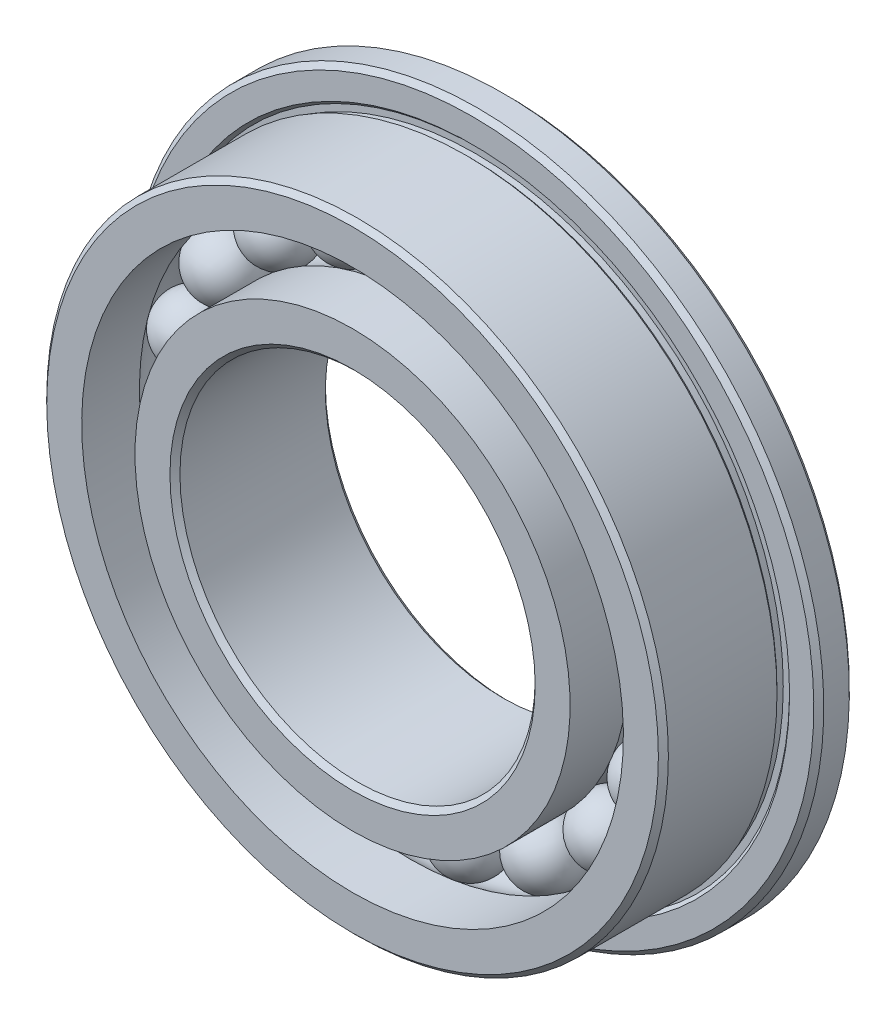
ISO-10303-21;
HEADER;
FILE_DESCRIPTION(('STEP AP214'),'2;1');
FILE_NAME('part.step','',(''),(''),'','','');
FILE_SCHEMA(('AUTOMOTIVE_DESIGN { 1 0 10303 214 1 1 1 1 }'));
ENDSEC;
DATA;
#1=APPLICATION_CONTEXT('core data for automotive mechanical design processes');
#2=APPLICATION_PROTOCOL_DEFINITION('international standard','automotive_design',2000,#1);
#3=PRODUCT_CONTEXT('',#1,'mechanical');
#4=PRODUCT('Part','Part','',(#3));
#5=PRODUCT_RELATED_PRODUCT_CATEGORY('part','',(#4));
#6=PRODUCT_DEFINITION_FORMATION('','',#4);
#7=PRODUCT_DEFINITION_CONTEXT('part definition',#1,'design');
#8=PRODUCT_DEFINITION('design','',#6,#7);
#9=PRODUCT_DEFINITION_SHAPE('','',#8);
#10=(LENGTH_UNIT() NAMED_UNIT(*) SI_UNIT(.MILLI.,.METRE.));
#11=(NAMED_UNIT(*) PLANE_ANGLE_UNIT() SI_UNIT($,.RADIAN.));
#12=(NAMED_UNIT(*) SI_UNIT($,.STERADIAN.) SOLID_ANGLE_UNIT());
#13=UNCERTAINTY_MEASURE_WITH_UNIT(LENGTH_MEASURE(1.E-05),#10,'distance_accuracy_value','');
#14=(GEOMETRIC_REPRESENTATION_CONTEXT(3) GLOBAL_UNCERTAINTY_ASSIGNED_CONTEXT((#13)) GLOBAL_UNIT_ASSIGNED_CONTEXT((#10,
#11,#12)) REPRESENTATION_CONTEXT('',''));
#15=CARTESIAN_POINT('',(0.,0.,0.));
#16=DIRECTION('',(0.,0.,1.));
#17=DIRECTION('',(1.,0.,0.));
#18=AXIS2_PLACEMENT_3D('',#15,#16,#17);
#19=CARTESIAN_POINT('',(-1.78584708062569,5.20199482935352,0.));
#20=DIRECTION('',(-0.324699469204671,0.945817241700639,0.));
#21=DIRECTION('',(0.945817241700639,0.324699469204671,0.));
#22=AXIS2_PLACEMENT_3D('',#19,#20,#21);
#23=SPHERICAL_SURFACE('',#22,0.75);
#24=CARTESIAN_POINT('',(-2.02937168252919,5.911357760629,0.));
#25=VERTEX_POINT('',#24);
#26=VERTEX_LOOP('',#25);
#27=FACE_BOUND('',#26,.T.);
#28=ADVANCED_FACE('F41',(#27),#23,.T.);
#29=CLOSED_SHELL('',(#28));
#30=MANIFOLD_SOLID_BREP('B2',#29);
#31=CARTESIAN_POINT('',(-3.37816991979312,4.34027280168021,0.));
#32=DIRECTION('',(-0.614212712689658,0.789140509396402,0.));
#33=DIRECTION('',(0.789140509396402,0.614212712689658,0.));
#34=AXIS2_PLACEMENT_3D('',#31,#32,#33);
#35=SPHERICAL_SURFACE('',#34,0.75);
#36=CARTESIAN_POINT('',(-3.83882945431036,4.93212818372751,0.));
#37=VERTEX_POINT('',#36);
#38=VERTEX_LOOP('',#37);
#39=FACE_BOUND('',#38,.T.);
#40=ADVANCED_FACE('F61',(#39),#35,.T.);
#41=CLOSED_SHELL('',(#40));
#42=MANIFOLD_SOLID_BREP('B7',#41);
#43=CARTESIAN_POINT('',(-4.60441563044387,3.0082148696734,0.));
#44=DIRECTION('',(-0.837166478262522,0.546948158122437,0.));
#45=DIRECTION('',(0.546948158122437,0.837166478262522,0.));
#46=AXIS2_PLACEMENT_3D('',#43,#44,#45);
#47=SPHERICAL_SURFACE('',#46,0.75);
#48=CARTESIAN_POINT('',(-5.23229048914076,3.41842598826523,0.));
#49=VERTEX_POINT('',#48);
#50=VERTEX_LOOP('',#49);
#51=FACE_BOUND('',#50,.T.);
#52=ADVANCED_FACE('F81',(#51),#47,.T.);
#53=CLOSED_SHELL('',(#52));
#54=MANIFOLD_SOLID_BREP('B37',#53);
#55=CARTESIAN_POINT('',(-5.3317014626663,1.35017017927445,0.));
#56=DIRECTION('',(-0.969400265939328,0.24548548714081,0.));
#57=DIRECTION('',(0.24548548714081,0.969400265939328,0.));
#58=AXIS2_PLACEMENT_3D('',#55,#56,#57);
#59=SPHERICAL_SURFACE('',#58,0.75);
#60=CARTESIAN_POINT('',(-6.0587516621208,1.53428429463006,0.));
#61=VERTEX_POINT('',#60);
#62=VERTEX_LOOP('',#61);
#63=FACE_BOUND('',#62,.T.);
#64=ADVANCED_FACE('F101',(#63),#59,.T.);
#65=CLOSED_SHELL('',(#64));
#66=MANIFOLD_SOLID_BREP('B57',#65);
#67=CARTESIAN_POINT('',(-5.48121471153669,-0.454186400097772,0.));
#68=DIRECTION('',(-0.996584493006671,-0.0825793454723223,0.));
#69=DIRECTION('',(-0.0825793454723223,0.996584493006671,0.));
#70=AXIS2_PLACEMENT_3D('',#67,#68,#69);
#71=SPHERICAL_SURFACE('',#70,0.75);
#72=CARTESIAN_POINT('',(-6.22865308129169,-0.516120909202013,0.));
#73=VERTEX_POINT('',#72);
#74=VERTEX_LOOP('',#73);
#75=FACE_BOUND('',#74,.T.);
#76=ADVANCED_FACE('F121',(#75),#71,.T.);
#77=CLOSED_SHELL('',(#76));
#78=MANIFOLD_SOLID_BREP('B77',#77);
#79=CARTESIAN_POINT('',(-5.03675329660284,-2.20932483559128,0.));
#80=DIRECTION('',(-0.915773326655062,-0.40169542465296,0.));
#81=DIRECTION('',(-0.40169542465296,0.915773326655062,0.));
#82=AXIS2_PLACEMENT_3D('',#79,#80,#81);
#83=SPHERICAL_SURFACE('',#82,0.75);
#84=CARTESIAN_POINT('',(-5.72358329159414,-2.510596404081,0.));
#85=VERTEX_POINT('',#84);
#86=VERTEX_LOOP('',#85);
#87=FACE_BOUND('',#86,.T.);
#88=ADVANCED_FACE('F141',(#87),#83,.T.);
#89=CLOSED_SHELL('',(#88));
#90=MANIFOLD_SOLID_BREP('B97',#89);
#91=CARTESIAN_POINT('',(-4.04648150870226,-3.72504864394154,0.));
#92=DIRECTION('',(-0.735723910673138,-0.677281571625734,0.));
#93=DIRECTION('',(-0.677281571625734,0.735723910673138,0.));
#94=AXIS2_PLACEMENT_3D('',#91,#92,#93);
#95=SPHERICAL_SURFACE('',#94,0.75);
#96=CARTESIAN_POINT('',(-4.59827444170711,-4.23300982266084,0.));
#97=VERTEX_POINT('',#96);
#98=VERTEX_LOOP('',#97);
#99=FACE_BOUND('',#98,.T.);
#100=ADVANCED_FACE('F161',(#99),#95,.T.);
#101=CLOSED_SHELL('',(#100));
#102=MANIFOLD_SOLID_BREP('B117',#101);
#103=CARTESIAN_POINT('',(-2.61771066170394,-4.83710563163567,0.));
#104=DIRECTION('',(-0.475947393037081,-0.879473751206485,0.));
#105=DIRECTION('',(-0.879473751206485,0.475947393037081,0.));
#106=AXIS2_PLACEMENT_3D('',#103,#104,#105);
#107=SPHERICAL_SURFACE('',#106,0.75);
#108=CARTESIAN_POINT('',(-2.97467120648176,-5.49671094504053,0.));
#109=VERTEX_POINT('',#108);
#110=VERTEX_LOOP('',#109);
#111=FACE_BOUND('',#110,.T.);
#112=ADVANCED_FACE('F181',(#111),#107,.T.);
#113=CLOSED_SHELL('',(#112));
#114=MANIFOLD_SOLID_BREP('B137',#113);
#115=CARTESIAN_POINT('',(-0.905270246544077,-5.42498716871497,0.));
#116=DIRECTION('',(-0.164594590280741,-0.986361303402721,0.));
#117=DIRECTION('',(-0.986361303402721,0.164594590280741,0.));
#118=AXIS2_PLACEMENT_3D('',#115,#116,#117);
#119=SPHERICAL_SURFACE('',#118,0.75);
#120=CARTESIAN_POINT('',(-1.02871618925463,-6.16475814626701,0.));
#121=VERTEX_POINT('',#120);
#122=VERTEX_LOOP('',#121);
#123=FACE_BOUND('',#122,.T.);
#124=ADVANCED_FACE('F201',(#123),#119,.T.);
#125=CLOSED_SHELL('',(#124));
#126=MANIFOLD_SOLID_BREP('B157',#125);
#127=CARTESIAN_POINT('',(0.905270246543999,-5.42498716871498,0.));
#128=DIRECTION('',(0.164594590280727,-0.986361303402724,0.));
#129=DIRECTION('',(-0.986361303402724,-0.164594590280727,0.));
#130=AXIS2_PLACEMENT_3D('',#127,#128,#129);
#131=SPHERICAL_SURFACE('',#130,0.75);
#132=CARTESIAN_POINT('',(1.02871618925454,-6.16475814626702,0.));
#133=VERTEX_POINT('',#132);
#134=VERTEX_LOOP('',#133);
#135=FACE_BOUND('',#134,.T.);
#136=ADVANCED_FACE('F221',(#135),#131,.T.);
#137=CLOSED_SHELL('',(#136));
#138=MANIFOLD_SOLID_BREP('B177',#137);
#139=CARTESIAN_POINT('',(2.61771066170388,-4.8371056316357,0.));
#140=DIRECTION('',(0.475947393037068,-0.879473751206492,0.));
#141=DIRECTION('',(-0.879473751206492,-0.475947393037068,0.));
#142=AXIS2_PLACEMENT_3D('',#139,#140,#141);
#143=SPHERICAL_SURFACE('',#142,0.75);
#144=CARTESIAN_POINT('',(2.97467120648168,-5.49671094504057,0.));
#145=VERTEX_POINT('',#144);
#146=VERTEX_LOOP('',#145);
#147=FACE_BOUND('',#146,.T.);
#148=ADVANCED_FACE('F241',(#147),#143,.T.);
#149=CLOSED_SHELL('',(#148));
#150=MANIFOLD_SOLID_BREP('B197',#149);
#151=CARTESIAN_POINT('',(4.0464815087022,-3.7250486439416,0.));
#152=DIRECTION('',(0.735723910673128,-0.677281571625745,0.));
#153=DIRECTION('',(-0.677281571625745,-0.735723910673128,0.));
#154=AXIS2_PLACEMENT_3D('',#151,#152,#153);
#155=SPHERICAL_SURFACE('',#154,0.75);
#156=CARTESIAN_POINT('',(4.59827444170705,-4.2330098226609,0.));
#157=VERTEX_POINT('',#156);
#158=VERTEX_LOOP('',#157);
#159=FACE_BOUND('',#158,.T.);
#160=ADVANCED_FACE('F261',(#159),#155,.T.);
#161=CLOSED_SHELL('',(#160));
#162=MANIFOLD_SOLID_BREP('B217',#161);
#163=CARTESIAN_POINT('',(5.03675329660281,-2.20932483559136,0.));
#164=DIRECTION('',(0.915773326655056,-0.401695424652974,0.));
#165=DIRECTION('',(-0.401695424652974,-0.915773326655056,0.));
#166=AXIS2_PLACEMENT_3D('',#163,#164,#165);
#167=SPHERICAL_SURFACE('',#166,0.75);
#168=CARTESIAN_POINT('',(5.7235832915941,-2.51059640408109,0.));
#169=VERTEX_POINT('',#168);
#170=VERTEX_LOOP('',#169);
#171=FACE_BOUND('',#170,.T.);
#172=ADVANCED_FACE('F281',(#171),#167,.T.);
#173=CLOSED_SHELL('',(#172));
#174=MANIFOLD_SOLID_BREP('B237',#173);
#175=CARTESIAN_POINT('',(5.48121471153668,-0.454186400097848,0.));
#176=DIRECTION('',(0.99658449300667,-0.0825793454723359,0.));
#177=DIRECTION('',(-0.0825793454723359,-0.99658449300667,0.));
#178=AXIS2_PLACEMENT_3D('',#175,#176,#177);
#179=SPHERICAL_SURFACE('',#178,0.75);
#180=CARTESIAN_POINT('',(6.22865308129169,-0.5161209092021,0.));
#181=VERTEX_POINT('',#180);
#182=VERTEX_LOOP('',#181);
#183=FACE_BOUND('',#182,.T.);
#184=ADVANCED_FACE('F301',(#183),#179,.T.);
#185=CLOSED_SHELL('',(#184));
#186=MANIFOLD_SOLID_BREP('B257',#185);
#187=CARTESIAN_POINT('',(5.33170146266632,1.35017017927438,0.));
#188=DIRECTION('',(0.969400265939331,0.245485487140796,0.));
#189=DIRECTION('',(0.245485487140796,-0.969400265939331,0.));
#190=AXIS2_PLACEMENT_3D('',#187,#188,#189);
#191=SPHERICAL_SURFACE('',#190,0.75);
#192=CARTESIAN_POINT('',(6.05875166212082,1.53428429462998,0.));
#193=VERTEX_POINT('',#192);
#194=VERTEX_LOOP('',#193);
#195=FACE_BOUND('',#194,.T.);
#196=ADVANCED_FACE('F321',(#195),#191,.T.);
#197=CLOSED_SHELL('',(#196));
#198=MANIFOLD_SOLID_BREP('B277',#197);
#199=CARTESIAN_POINT('',(4.60441563044391,3.00821486967334,0.));
#200=DIRECTION('',(0.83716647826253,0.546948158122425,0.));
#201=DIRECTION('',(0.546948158122425,-0.83716647826253,0.));
#202=AXIS2_PLACEMENT_3D('',#199,#200,#201);
#203=SPHERICAL_SURFACE('',#202,0.75);
#204=CARTESIAN_POINT('',(5.23229048914081,3.41842598826516,0.));
#205=VERTEX_POINT('',#204);
#206=VERTEX_LOOP('',#205);
#207=FACE_BOUND('',#206,.T.);
#208=ADVANCED_FACE('F341',(#207),#203,.T.);
#209=CLOSED_SHELL('',(#208));
#210=MANIFOLD_SOLID_BREP('B297',#209);
#211=CARTESIAN_POINT('',(3.37816991979318,4.34027280168016,0.));
#212=DIRECTION('',(0.614212712689669,0.789140509396393,0.));
#213=DIRECTION('',(0.789140509396393,-0.614212712689669,0.));
#214=AXIS2_PLACEMENT_3D('',#211,#212,#213);
#215=SPHERICAL_SURFACE('',#214,0.75);
#216=CARTESIAN_POINT('',(3.83882945431043,4.93212818372745,0.));
#217=VERTEX_POINT('',#216);
#218=VERTEX_LOOP('',#217);
#219=FACE_BOUND('',#218,.T.);
#220=ADVANCED_FACE('F361',(#219),#215,.T.);
#221=CLOSED_SHELL('',(#220));
#222=MANIFOLD_SOLID_BREP('B317',#221);
#223=CARTESIAN_POINT('',(1.78584708062576,5.20199482935349,0.));
#224=DIRECTION('',(0.324699469204684,0.945817241700635,0.));
#225=DIRECTION('',(0.945817241700635,-0.324699469204684,0.));
#226=AXIS2_PLACEMENT_3D('',#223,#224,#225);
#227=SPHERICAL_SURFACE('',#226,0.75);
#228=CARTESIAN_POINT('',(2.02937168252928,5.91135776062897,0.));
#229=VERTEX_POINT('',#228);
#230=VERTEX_LOOP('',#229);
#231=FACE_BOUND('',#230,.T.);
#232=ADVANCED_FACE('F381',(#231),#227,.T.);
#233=CLOSED_SHELL('',(#232));
#234=MANIFOLD_SOLID_BREP('B337',#233);
#235=CARTESIAN_POINT('',(0.,5.5,0.));
#236=DIRECTION('',(0.,1.,0.));
#237=DIRECTION('',(1.,0.,0.));
#238=AXIS2_PLACEMENT_3D('',#235,#236,#237);
#239=SPHERICAL_SURFACE('',#238,0.75);
#240=CARTESIAN_POINT('',(0.,6.25,0.));
#241=VERTEX_POINT('',#240);
#242=VERTEX_LOOP('',#241);
#243=FACE_BOUND('',#242,.T.);
#244=ADVANCED_FACE('F404',(#243),#239,.T.);
#245=CLOSED_SHELL('',(#244));
#246=MANIFOLD_SOLID_BREP('B357',#245);
#247=CARTESIAN_POINT('',(0.,0.,0.));
#248=DIRECTION('',(0.,0.,1.));
#249=DIRECTION('',(0.,-1.,0.));
#250=AXIS2_PLACEMENT_3D('',#247,#248,#249);
#251=CYLINDRICAL_SURFACE('',#250,4.9);
#252=CARTESIAN_POINT('',(0.,0.,-0.449999999999999));
#253=DIRECTION('',(0.,0.,1.));
#254=DIRECTION('',(0.,-1.,0.));
#255=AXIS2_PLACEMENT_3D('',#252,#253,#254);
#256=CIRCLE('',#255,4.9);
#257=CARTESIAN_POINT('',(0.,-4.9,-0.449999999999999));
#258=VERTEX_POINT('',#257);
#259=EDGE_CURVE('E445',#258,#258,#256,.T.);
#260=ORIENTED_EDGE('',*,*,#259,.F.);
#261=EDGE_LOOP('',(#260));
#262=FACE_BOUND('',#261,.T.);
#263=CARTESIAN_POINT('',(0.,0.,-1.75));
#264=DIRECTION('',(0.,0.,1.));
#265=DIRECTION('',(0.,-1.,0.));
#266=AXIS2_PLACEMENT_3D('',#263,#264,#265);
#267=CIRCLE('',#266,4.9);
#268=CARTESIAN_POINT('',(0.,-4.9,-1.75));
#269=VERTEX_POINT('',#268);
#270=EDGE_CURVE('E454',#269,#269,#267,.T.);
#271=ORIENTED_EDGE('',*,*,#270,.T.);
#272=EDGE_LOOP('',(#271));
#273=FACE_BOUND('',#272,.T.);
#274=ADVANCED_FACE('F425',(#262,#273),#251,.T.);
#275=CARTESIAN_POINT('',(0.,0.,0.));
#276=DIRECTION('',(0.,0.,1.));
#277=DIRECTION('',(0.,-1.,0.));
#278=AXIS2_PLACEMENT_3D('',#275,#276,#277);
#279=TOROIDAL_SURFACE('',#278,5.5,0.75);
#280=CARTESIAN_POINT('',(0.,0.,0.45));
#281=DIRECTION('',(0.,0.,1.));
#282=DIRECTION('',(0.,-1.,0.));
#283=AXIS2_PLACEMENT_3D('',#280,#281,#282);
#284=CIRCLE('',#283,4.9);
#285=CARTESIAN_POINT('',(0.,-4.9,0.45));
#286=VERTEX_POINT('',#285);
#287=EDGE_CURVE('E448',#286,#286,#284,.T.);
#288=ORIENTED_EDGE('',*,*,#287,.F.);
#289=EDGE_LOOP('',(#288));
#290=FACE_BOUND('',#289,.T.);
#291=ORIENTED_EDGE('',*,*,#259,.T.);
#292=EDGE_LOOP('',(#291));
#293=FACE_BOUND('',#292,.T.);
#294=ADVANCED_FACE('F473',(#290,#293),#279,.F.);
#295=CARTESIAN_POINT('',(0.,0.,0.));
#296=DIRECTION('',(0.,0.,1.));
#297=DIRECTION('',(0.,-1.,0.));
#298=AXIS2_PLACEMENT_3D('',#295,#296,#297);
#299=CYLINDRICAL_SURFACE('',#298,4.9);
#300=CARTESIAN_POINT('',(0.,0.,1.75));
#301=DIRECTION('',(0.,0.,1.));
#302=DIRECTION('',(0.,-1.,0.));
#303=AXIS2_PLACEMENT_3D('',#300,#301,#302);
#304=CIRCLE('',#303,4.9);
#305=CARTESIAN_POINT('',(0.,-4.9,1.75));
#306=VERTEX_POINT('',#305);
#307=EDGE_CURVE('E451',#306,#306,#304,.T.);
#308=ORIENTED_EDGE('',*,*,#307,.F.);
#309=EDGE_LOOP('',(#308));
#310=FACE_BOUND('',#309,.T.);
#311=ORIENTED_EDGE('',*,*,#287,.T.);
#312=EDGE_LOOP('',(#311));
#313=FACE_BOUND('',#312,.T.);
#314=ADVANCED_FACE('F479',(#310,#313),#299,.T.);
#315=CARTESIAN_POINT('',(0.,4.,1.75));
#316=DIRECTION('',(0.,0.,-1.));
#317=DIRECTION('',(0.,1.,0.));
#318=AXIS2_PLACEMENT_3D('',#315,#316,#317);
#319=PLANE('',#318);
#320=CARTESIAN_POINT('',(0.,0.,1.75));
#321=DIRECTION('',(0.,0.,-1.));
#322=DIRECTION('',(0.,1.,0.));
#323=AXIS2_PLACEMENT_3D('',#320,#321,#322);
#324=CIRCLE('',#323,4.1125);
#325=CARTESIAN_POINT('',(0.,4.1125,1.75));
#326=VERTEX_POINT('',#325);
#327=EDGE_CURVE('E403',#326,#326,#324,.T.);
#328=ORIENTED_EDGE('',*,*,#327,.T.);
#329=EDGE_LOOP('',(#328));
#330=FACE_BOUND('',#329,.T.);
#331=ORIENTED_EDGE('',*,*,#307,.T.);
#332=EDGE_LOOP('',(#331));
#333=FACE_BOUND('',#332,.T.);
#334=ADVANCED_FACE('F470',(#330,#333),#319,.F.);
#335=CARTESIAN_POINT('',(0.,0.,0.));
#336=DIRECTION('',(0.,0.,1.));
#337=DIRECTION('',(0.,-1.,0.));
#338=AXIS2_PLACEMENT_3D('',#335,#336,#337);
#339=CYLINDRICAL_SURFACE('',#338,4.);
#340=CARTESIAN_POINT('',(0.,0.,-1.6375));
#341=DIRECTION('',(0.,0.,1.));
#342=DIRECTION('',(0.,-1.,0.));
#343=AXIS2_PLACEMENT_3D('',#340,#341,#342);
#344=CIRCLE('',#343,4.);
#345=CARTESIAN_POINT('',(0.,-4.,-1.6375));
#346=VERTEX_POINT('',#345);
#347=EDGE_CURVE('E432',#346,#346,#344,.F.);
#348=ORIENTED_EDGE('',*,*,#347,.T.);
#349=EDGE_LOOP('',(#348));
#350=FACE_BOUND('',#349,.T.);
#351=CARTESIAN_POINT('',(0.,0.,1.6375));
#352=DIRECTION('',(0.,0.,-1.));
#353=DIRECTION('',(0.,1.,0.));
#354=AXIS2_PLACEMENT_3D('',#351,#352,#353);
#355=CIRCLE('',#354,4.);
#356=CARTESIAN_POINT('',(0.,4.,1.6375));
#357=VERTEX_POINT('',#356);
#358=EDGE_CURVE('E436',#357,#357,#355,.F.);
#359=ORIENTED_EDGE('',*,*,#358,.T.);
#360=EDGE_LOOP('',(#359));
#361=FACE_BOUND('',#360,.T.);
#362=ADVANCED_FACE('F462',(#350,#361),#339,.F.);
#363=CARTESIAN_POINT('',(0.,4.9,-1.75));
#364=DIRECTION('',(0.,0.,1.));
#365=DIRECTION('',(0.,-1.,0.));
#366=AXIS2_PLACEMENT_3D('',#363,#364,#365);
#367=PLANE('',#366);
#368=CARTESIAN_POINT('',(0.,0.,-1.75));
#369=DIRECTION('',(0.,0.,1.));
#370=DIRECTION('',(0.,-1.,0.));
#371=AXIS2_PLACEMENT_3D('',#368,#369,#370);
#372=CIRCLE('',#371,4.1125);
#373=CARTESIAN_POINT('',(0.,-4.1125,-1.75));
#374=VERTEX_POINT('',#373);
#375=EDGE_CURVE('E440',#374,#374,#372,.T.);
#376=ORIENTED_EDGE('',*,*,#375,.T.);
#377=EDGE_LOOP('',(#376));
#378=FACE_BOUND('',#377,.T.);
#379=ORIENTED_EDGE('',*,*,#270,.F.);
#380=EDGE_LOOP('',(#379));
#381=FACE_BOUND('',#380,.T.);
#382=ADVANCED_FACE('F459',(#378,#381),#367,.F.);
#383=CARTESIAN_POINT('',(0.,0.,-1.75));
#384=DIRECTION('',(0.,0.,-1.));
#385=DIRECTION('',(0.,1.,0.));
#386=AXIS2_PLACEMENT_3D('',#383,#384,#385);
#387=CONICAL_SURFACE('',#386,4.1125,0.785398163397446);
#388=ORIENTED_EDGE('',*,*,#347,.F.);
#389=EDGE_LOOP('',(#388));
#390=FACE_BOUND('',#389,.T.);
#391=ORIENTED_EDGE('',*,*,#375,.F.);
#392=EDGE_LOOP('',(#391));
#393=FACE_BOUND('',#392,.T.);
#394=ADVANCED_FACE('F461',(#390,#393),#387,.F.);
#395=CARTESIAN_POINT('',(0.,0.,1.6375));
#396=DIRECTION('',(0.,0.,1.));
#397=DIRECTION('',(0.,-1.,0.));
#398=AXIS2_PLACEMENT_3D('',#395,#396,#397);
#399=CONICAL_SURFACE('',#398,4.,0.785398163397446);
#400=ORIENTED_EDGE('',*,*,#327,.F.);
#401=EDGE_LOOP('',(#400));
#402=FACE_BOUND('',#401,.T.);
#403=ORIENTED_EDGE('',*,*,#358,.F.);
#404=EDGE_LOOP('',(#403));
#405=FACE_BOUND('',#404,.T.);
#406=ADVANCED_FACE('F427',(#402,#405),#399,.F.);
#407=CLOSED_SHELL('',(#274,#294,#314,#334,#362,#382,#394,#406));
#408=MANIFOLD_SOLID_BREP('B377',#407);
#409=CARTESIAN_POINT('',(0.,6.1,-1.75));
#410=DIRECTION('',(0.,0.,1.));
#411=DIRECTION('',(0.,-1.,0.));
#412=AXIS2_PLACEMENT_3D('',#409,#410,#411);
#413=PLANE('',#412);
#414=CARTESIAN_POINT('',(0.,0.,-1.75));
#415=DIRECTION('',(0.,0.,1.));
#416=DIRECTION('',(0.,-1.,0.));
#417=AXIS2_PLACEMENT_3D('',#414,#415,#416);
#418=CIRCLE('',#417,7.6875);
#419=CARTESIAN_POINT('',(0.,-7.6875,-1.75));
#420=VERTEX_POINT('',#419);
#421=EDGE_CURVE('E562',#420,#420,#418,.F.);
#422=ORIENTED_EDGE('',*,*,#421,.T.);
#423=EDGE_LOOP('',(#422));
#424=FACE_BOUND('',#423,.T.);
#425=CARTESIAN_POINT('',(0.,0.,-1.75));
#426=DIRECTION('',(0.,0.,1.));
#427=DIRECTION('',(0.,-1.,0.));
#428=AXIS2_PLACEMENT_3D('',#425,#426,#427);
#429=CIRCLE('',#428,6.1);
#430=CARTESIAN_POINT('',(0.,-6.1,-1.75));
#431=VERTEX_POINT('',#430);
#432=EDGE_CURVE('E573',#431,#431,#429,.T.);
#433=ORIENTED_EDGE('',*,*,#432,.T.);
#434=EDGE_LOOP('',(#433));
#435=FACE_BOUND('',#434,.T.);
#436=ADVANCED_FACE('F547',(#424,#435),#413,.F.);
#437=CARTESIAN_POINT('',(0.,0.,0.));
#438=DIRECTION('',(0.,0.,1.));
#439=DIRECTION('',(0.,-1.,0.));
#440=AXIS2_PLACEMENT_3D('',#437,#438,#439);
#441=CYLINDRICAL_SURFACE('',#440,6.1);
#442=ORIENTED_EDGE('',*,*,#432,.F.);
#443=EDGE_LOOP('',(#442));
#444=FACE_BOUND('',#443,.T.);
#445=CARTESIAN_POINT('',(0.,0.,-0.45));
#446=DIRECTION('',(0.,0.,1.));
#447=DIRECTION('',(0.,-1.,0.));
#448=AXIS2_PLACEMENT_3D('',#445,#446,#447);
#449=CIRCLE('',#448,6.1);
#450=CARTESIAN_POINT('',(0.,-6.1,-0.45));
#451=VERTEX_POINT('',#450);
#452=EDGE_CURVE('E576',#451,#451,#449,.T.);
#453=ORIENTED_EDGE('',*,*,#452,.T.);
#454=EDGE_LOOP('',(#453));
#455=FACE_BOUND('',#454,.T.);
#456=ADVANCED_FACE('F619',(#444,#455),#441,.F.);
#457=CARTESIAN_POINT('',(0.,0.,0.));
#458=DIRECTION('',(0.,0.,1.));
#459=DIRECTION('',(0.,-1.,0.));
#460=AXIS2_PLACEMENT_3D('',#457,#458,#459);
#461=TOROIDAL_SURFACE('',#460,5.5,0.75);
#462=ORIENTED_EDGE('',*,*,#452,.F.);
#463=EDGE_LOOP('',(#462));
#464=FACE_BOUND('',#463,.T.);
#465=CARTESIAN_POINT('',(0.,0.,0.45));
#466=DIRECTION('',(0.,0.,1.));
#467=DIRECTION('',(0.,-1.,0.));
#468=AXIS2_PLACEMENT_3D('',#465,#466,#467);
#469=CIRCLE('',#468,6.1);
#470=CARTESIAN_POINT('',(0.,-6.1,0.45));
#471=VERTEX_POINT('',#470);
#472=EDGE_CURVE('E579',#471,#471,#469,.T.);
#473=ORIENTED_EDGE('',*,*,#472,.T.);
#474=EDGE_LOOP('',(#473));
#475=FACE_BOUND('',#474,.T.);
#476=ADVANCED_FACE('F625',(#464,#475),#461,.F.);
#477=CARTESIAN_POINT('',(0.,0.,0.));
#478=DIRECTION('',(0.,0.,1.));
#479=DIRECTION('',(0.,-1.,0.));
#480=AXIS2_PLACEMENT_3D('',#477,#478,#479);
#481=CYLINDRICAL_SURFACE('',#480,6.1);
#482=ORIENTED_EDGE('',*,*,#472,.F.);
#483=EDGE_LOOP('',(#482));
#484=FACE_BOUND('',#483,.T.);
#485=CARTESIAN_POINT('',(0.,0.,1.75));
#486=DIRECTION('',(0.,0.,1.));
#487=DIRECTION('',(0.,-1.,0.));
#488=AXIS2_PLACEMENT_3D('',#485,#486,#487);
#489=CIRCLE('',#488,6.1);
#490=CARTESIAN_POINT('',(0.,-6.1,1.75));
#491=VERTEX_POINT('',#490);
#492=EDGE_CURVE('E582',#491,#491,#489,.T.);
#493=ORIENTED_EDGE('',*,*,#492,.T.);
#494=EDGE_LOOP('',(#493));
#495=FACE_BOUND('',#494,.T.);
#496=ADVANCED_FACE('F689',(#484,#495),#481,.F.);
#497=CARTESIAN_POINT('',(0.,7.,1.75));
#498=DIRECTION('',(0.,0.,-1.));
#499=DIRECTION('',(0.,1.,0.));
#500=AXIS2_PLACEMENT_3D('',#497,#498,#499);
#501=PLANE('',#500);
#502=CARTESIAN_POINT('',(0.,0.,1.75));
#503=DIRECTION('',(0.,0.,-1.));
#504=DIRECTION('',(0.,1.,0.));
#505=AXIS2_PLACEMENT_3D('',#502,#503,#504);
#506=CIRCLE('',#505,6.8875);
#507=CARTESIAN_POINT('',(0.,6.8875,1.75));
#508=VERTEX_POINT('',#507);
#509=EDGE_CURVE('E554',#508,#508,#506,.F.);
#510=ORIENTED_EDGE('',*,*,#509,.T.);
#511=EDGE_LOOP('',(#510));
#512=FACE_BOUND('',#511,.T.);
#513=ORIENTED_EDGE('',*,*,#492,.F.);
#514=EDGE_LOOP('',(#513));
#515=FACE_BOUND('',#514,.T.);
#516=ADVANCED_FACE('F679',(#512,#515),#501,.F.);
#517=CARTESIAN_POINT('',(0.,0.,0.));
#518=DIRECTION('',(0.,0.,1.));
#519=DIRECTION('',(0.,-1.,0.));
#520=AXIS2_PLACEMENT_3D('',#517,#518,#519);
#521=CYLINDRICAL_SURFACE('',#520,7.);
#522=CARTESIAN_POINT('',(0.,0.,1.6375));
#523=DIRECTION('',(0.,0.,-1.));
#524=DIRECTION('',(0.,1.,0.));
#525=AXIS2_PLACEMENT_3D('',#522,#523,#524);
#526=CIRCLE('',#525,7.);
#527=CARTESIAN_POINT('',(0.,7.,1.6375));
#528=VERTEX_POINT('',#527);
#529=EDGE_CURVE('E424',#528,#528,#526,.T.);
#530=ORIENTED_EDGE('',*,*,#529,.T.);
#531=EDGE_LOOP('',(#530));
#532=FACE_BOUND('',#531,.T.);
#533=CARTESIAN_POINT('',(0.,0.,-0.808578643762693));
#534=DIRECTION('',(0.,0.,1.));
#535=DIRECTION('',(0.,-1.,0.));
#536=AXIS2_PLACEMENT_3D('',#533,#534,#535);
#537=CIRCLE('',#536,7.);
#538=CARTESIAN_POINT('',(0.,-7.,-0.808578643762693));
#539=VERTEX_POINT('',#538);
#540=EDGE_CURVE('E585',#539,#539,#537,.T.);
#541=ORIENTED_EDGE('',*,*,#540,.T.);
#542=EDGE_LOOP('',(#541));
#543=FACE_BOUND('',#542,.T.);
#544=ADVANCED_FACE('F673',(#532,#543),#521,.T.);
#545=CARTESIAN_POINT('',(0.,0.,-0.879289321881346));
#546=DIRECTION('',(0.,0.,1.));
#547=DIRECTION('',(0.,-1.,0.));
#548=AXIS2_PLACEMENT_3D('',#545,#546,#547);
#549=CONICAL_SURFACE('',#548,6.92928932188135,0.78539816339745);
#550=ORIENTED_EDGE('',*,*,#540,.F.);
#551=EDGE_LOOP('',(#550));
#552=FACE_BOUND('',#551,.T.);
#553=CARTESIAN_POINT('',(0.,0.,-0.879289321881346));
#554=DIRECTION('',(0.,0.,1.));
#555=DIRECTION('',(0.,-1.,0.));
#556=AXIS2_PLACEMENT_3D('',#553,#554,#555);
#557=CIRCLE('',#556,6.92928932188135);
#558=CARTESIAN_POINT('',(0.,-6.92928932188135,-0.879289321881347));
#559=VERTEX_POINT('',#558);
#560=EDGE_CURVE('E588',#559,#559,#557,.T.);
#561=ORIENTED_EDGE('',*,*,#560,.T.);
#562=EDGE_LOOP('',(#561));
#563=FACE_BOUND('',#562,.T.);
#564=ADVANCED_FACE('F678',(#552,#563),#549,.T.);
#565=CARTESIAN_POINT('',(0.,0.,0.));
#566=DIRECTION('',(0.,0.,1.));
#567=DIRECTION('',(0.,-1.,0.));
#568=AXIS2_PLACEMENT_3D('',#565,#566,#567);
#569=CYLINDRICAL_SURFACE('',#568,6.92928932188135);
#570=ORIENTED_EDGE('',*,*,#560,.F.);
#571=EDGE_LOOP('',(#570));
#572=FACE_BOUND('',#571,.T.);
#573=CARTESIAN_POINT('',(0.,0.,-1.02071067811866));
#574=DIRECTION('',(0.,0.,1.));
#575=DIRECTION('',(0.,-1.,0.));
#576=AXIS2_PLACEMENT_3D('',#573,#574,#575);
#577=CIRCLE('',#576,6.92928932188135);
#578=CARTESIAN_POINT('',(0.,-6.92928932188135,-1.02071067811866));
#579=VERTEX_POINT('',#578);
#580=EDGE_CURVE('E591',#579,#579,#577,.T.);
#581=ORIENTED_EDGE('',*,*,#580,.T.);
#582=EDGE_LOOP('',(#581));
#583=FACE_BOUND('',#582,.T.);
#584=ADVANCED_FACE('F711',(#572,#583),#569,.T.);
#585=CARTESIAN_POINT('',(0.,7.07071067811866,-1.02071067811866));
#586=DIRECTION('',(0.,0.,-1.));
#587=DIRECTION('',(0.,1.,0.));
#588=AXIS2_PLACEMENT_3D('',#585,#586,#587);
#589=PLANE('',#588);
#590=ORIENTED_EDGE('',*,*,#580,.F.);
#591=EDGE_LOOP('',(#590));
#592=FACE_BOUND('',#591,.T.);
#593=CARTESIAN_POINT('',(0.,0.,-1.02071067811866));
#594=DIRECTION('',(0.,0.,1.));
#595=DIRECTION('',(0.,-1.,0.));
#596=AXIS2_PLACEMENT_3D('',#593,#594,#595);
#597=CIRCLE('',#596,7.07071067811866);
#598=CARTESIAN_POINT('',(0.,-7.07071067811866,-1.02071067811866));
#599=VERTEX_POINT('',#598);
#600=EDGE_CURVE('E594',#599,#599,#597,.T.);
#601=ORIENTED_EDGE('',*,*,#600,.T.);
#602=EDGE_LOOP('',(#601));
#603=FACE_BOUND('',#602,.T.);
#604=ADVANCED_FACE('F615',(#592,#603),#589,.F.);
#605=CARTESIAN_POINT('',(0.,0.,-0.950000000000001));
#606=DIRECTION('',(0.,0.,1.));
#607=DIRECTION('',(0.,-1.,0.));
#608=AXIS2_PLACEMENT_3D('',#605,#606,#607);
#609=CONICAL_SURFACE('',#608,7.14142135623731,0.785398163397448);
#610=ORIENTED_EDGE('',*,*,#600,.F.);
#611=EDGE_LOOP('',(#610));
#612=FACE_BOUND('',#611,.T.);
#613=CARTESIAN_POINT('',(0.,0.,-0.950000000000001));
#614=DIRECTION('',(0.,0.,1.));
#615=DIRECTION('',(0.,-1.,0.));
#616=AXIS2_PLACEMENT_3D('',#613,#614,#615);
#617=CIRCLE('',#616,7.14142135623731);
#618=CARTESIAN_POINT('',(0.,-7.14142135623731,-0.950000000000001));
#619=VERTEX_POINT('',#618);
#620=EDGE_CURVE('E597',#619,#619,#617,.T.);
#621=ORIENTED_EDGE('',*,*,#620,.T.);
#622=EDGE_LOOP('',(#621));
#623=FACE_BOUND('',#622,.T.);
#624=ADVANCED_FACE('F601',(#612,#623),#609,.F.);
#625=CARTESIAN_POINT('',(0.,7.8,-0.950000000000001));
#626=DIRECTION('',(0.,0.,-1.));
#627=DIRECTION('',(0.,1.,0.));
#628=AXIS2_PLACEMENT_3D('',#625,#626,#627);
#629=PLANE('',#628);
#630=CARTESIAN_POINT('',(0.,0.,-0.950000000000001));
#631=DIRECTION('',(0.,0.,-1.));
#632=DIRECTION('',(0.,1.,0.));
#633=AXIS2_PLACEMENT_3D('',#630,#631,#632);
#634=CIRCLE('',#633,7.6875);
#635=CARTESIAN_POINT('',(0.,7.6875,-0.95));
#636=VERTEX_POINT('',#635);
#637=EDGE_CURVE('E558',#636,#636,#634,.F.);
#638=ORIENTED_EDGE('',*,*,#637,.T.);
#639=EDGE_LOOP('',(#638));
#640=FACE_BOUND('',#639,.T.);
#641=ORIENTED_EDGE('',*,*,#620,.F.);
#642=EDGE_LOOP('',(#641));
#643=FACE_BOUND('',#642,.T.);
#644=ADVANCED_FACE('F603',(#640,#643),#629,.F.);
#645=CARTESIAN_POINT('',(0.,0.,0.));
#646=DIRECTION('',(0.,0.,1.));
#647=DIRECTION('',(0.,-1.,0.));
#648=AXIS2_PLACEMENT_3D('',#645,#646,#647);
#649=CYLINDRICAL_SURFACE('',#648,7.8);
#650=CARTESIAN_POINT('',(0.,0.,-1.6375));
#651=DIRECTION('',(0.,0.,1.));
#652=DIRECTION('',(0.,-1.,0.));
#653=AXIS2_PLACEMENT_3D('',#650,#651,#652);
#654=CIRCLE('',#653,7.8);
#655=CARTESIAN_POINT('',(0.,-7.8,-1.6375));
#656=VERTEX_POINT('',#655);
#657=EDGE_CURVE('E567',#656,#656,#654,.T.);
#658=ORIENTED_EDGE('',*,*,#657,.T.);
#659=EDGE_LOOP('',(#658));
#660=FACE_BOUND('',#659,.T.);
#661=CARTESIAN_POINT('',(0.,0.,-1.0625));
#662=DIRECTION('',(0.,0.,-1.));
#663=DIRECTION('',(0.,1.,0.));
#664=AXIS2_PLACEMENT_3D('',#661,#662,#663);
#665=CIRCLE('',#664,7.8);
#666=CARTESIAN_POINT('',(0.,7.8,-1.0625));
#667=VERTEX_POINT('',#666);
#668=EDGE_CURVE('E570',#667,#667,#665,.T.);
#669=ORIENTED_EDGE('',*,*,#668,.T.);
#670=EDGE_LOOP('',(#669));
#671=FACE_BOUND('',#670,.T.);
#672=ADVANCED_FACE('F605',(#660,#671),#649,.T.);
#673=CARTESIAN_POINT('',(0.,0.,-1.6375));
#674=DIRECTION('',(0.,0.,1.));
#675=DIRECTION('',(0.,-1.,0.));
#676=AXIS2_PLACEMENT_3D('',#673,#674,#675);
#677=CONICAL_SURFACE('',#676,7.8,0.785398163397446);
#678=ORIENTED_EDGE('',*,*,#421,.F.);
#679=EDGE_LOOP('',(#678));
#680=FACE_BOUND('',#679,.T.);
#681=ORIENTED_EDGE('',*,*,#657,.F.);
#682=EDGE_LOOP('',(#681));
#683=FACE_BOUND('',#682,.T.);
#684=ADVANCED_FACE('F612',(#680,#683),#677,.T.);
#685=CARTESIAN_POINT('',(0.,0.,-0.950000000000001));
#686=DIRECTION('',(0.,0.,-1.));
#687=DIRECTION('',(0.,1.,0.));
#688=AXIS2_PLACEMENT_3D('',#685,#686,#687);
#689=CONICAL_SURFACE('',#688,7.6875,0.785398163397446);
#690=CARTESIAN_POINT('',(0.,7.8,-1.0625));
#691=CARTESIAN_POINT('',(0.,7.798828125,-1.061328125));
#692=CARTESIAN_POINT('',(0.,7.79765625,-1.06015625));
#693=CARTESIAN_POINT('',(0.,7.7953125,-1.0578125));
#694=CARTESIAN_POINT('',(0.,7.794140625,-1.056640625));
#695=CARTESIAN_POINT('',(0.,7.791796875,-1.054296875));
#696=CARTESIAN_POINT('',(0.,7.790625,-1.053125));
#697=CARTESIAN_POINT('',(0.,7.78828125,-1.05078125));
#698=CARTESIAN_POINT('',(0.,7.787109375,-1.049609375));
#699=CARTESIAN_POINT('',(0.,7.784765625,-1.047265625));
#700=CARTESIAN_POINT('',(0.,7.78359375,-1.04609375));
#701=CARTESIAN_POINT('',(0.,7.78125,-1.04375));
#702=CARTESIAN_POINT('',(0.,7.780078125,-1.042578125));
#703=CARTESIAN_POINT('',(0.,7.777734375,-1.040234375));
#704=CARTESIAN_POINT('',(0.,7.7765625,-1.0390625));
#705=CARTESIAN_POINT('',(0.,7.77421875,-1.03671875));
#706=CARTESIAN_POINT('',(0.,7.773046875,-1.035546875));
#707=CARTESIAN_POINT('',(0.,7.770703125,-1.033203125));
#708=CARTESIAN_POINT('',(0.,7.76953125,-1.03203125));
#709=CARTESIAN_POINT('',(0.,7.7671875,-1.0296875));
#710=CARTESIAN_POINT('',(0.,7.766015625,-1.028515625));
#711=CARTESIAN_POINT('',(0.,7.763671875,-1.026171875));
#712=CARTESIAN_POINT('',(0.,7.7625,-1.025));
#713=CARTESIAN_POINT('',(0.,7.76015625,-1.02265625));
#714=CARTESIAN_POINT('',(0.,7.758984375,-1.021484375));
#715=CARTESIAN_POINT('',(0.,7.756640625,-1.019140625));
#716=CARTESIAN_POINT('',(0.,7.75546875,-1.01796875));
#717=CARTESIAN_POINT('',(0.,7.753125,-1.015625));
#718=CARTESIAN_POINT('',(0.,7.751953125,-1.014453125));
#719=CARTESIAN_POINT('',(0.,7.749609375,-1.012109375));
#720=CARTESIAN_POINT('',(0.,7.7484375,-1.0109375));
#721=CARTESIAN_POINT('',(0.,7.74609375,-1.00859375));
#722=CARTESIAN_POINT('',(0.,7.744921875,-1.007421875));
#723=CARTESIAN_POINT('',(0.,7.742578125,-1.005078125));
#724=CARTESIAN_POINT('',(0.,7.74140625,-1.00390625));
#725=CARTESIAN_POINT('',(0.,7.7390625,-1.0015625));
#726=CARTESIAN_POINT('',(0.,7.737890625,-1.000390625));
#727=CARTESIAN_POINT('',(0.,7.735546875,-0.998046875000001));
#728=CARTESIAN_POINT('',(0.,7.734375,-0.996875000000001));
#729=CARTESIAN_POINT('',(0.,7.73203125,-0.994531250000001));
#730=CARTESIAN_POINT('',(0.,7.730859375,-0.993359375000001));
#731=CARTESIAN_POINT('',(0.,7.728515625,-0.991015625000001));
#732=CARTESIAN_POINT('',(0.,7.72734375,-0.98984375));
#733=CARTESIAN_POINT('',(0.,7.725,-0.9875));
#734=CARTESIAN_POINT('',(0.,7.723828125,-0.986328125000001));
#735=CARTESIAN_POINT('',(0.,7.721484375,-0.983984375000001));
#736=CARTESIAN_POINT('',(0.,7.7203125,-0.9828125));
#737=CARTESIAN_POINT('',(0.,7.71796875,-0.98046875));
#738=CARTESIAN_POINT('',(0.,7.716796875,-0.979296875000001));
#739=CARTESIAN_POINT('',(0.,7.714453125,-0.976953125000001));
#740=CARTESIAN_POINT('',(0.,7.71328125,-0.975781250000001));
#741=CARTESIAN_POINT('',(0.,7.7109375,-0.9734375));
#742=CARTESIAN_POINT('',(0.,7.709765625,-0.972265625));
#743=CARTESIAN_POINT('',(0.,7.707421875,-0.969921875));
#744=CARTESIAN_POINT('',(0.,7.70625,-0.968750000000001));
#745=CARTESIAN_POINT('',(0.,7.70390625,-0.966406250000001));
#746=CARTESIAN_POINT('',(0.,7.702734375,-0.965234375000001));
#747=CARTESIAN_POINT('',(0.,7.700390625,-0.962890625));
#748=CARTESIAN_POINT('',(0.,7.69921875,-0.961718750000001));
#749=CARTESIAN_POINT('',(0.,7.696875,-0.959375000000001));
#750=CARTESIAN_POINT('',(0.,7.695703125,-0.958203125));
#751=CARTESIAN_POINT('',(0.,7.693359375,-0.955859375));
#752=CARTESIAN_POINT('',(0.,7.6921875,-0.9546875));
#753=CARTESIAN_POINT('',(0.,7.68984375,-0.952343750000001));
#754=CARTESIAN_POINT('',(0.,7.688671875,-0.951171875000001));
#755=CARTESIAN_POINT('',(0.,7.6875,-0.950000000000001));
#756=B_SPLINE_CURVE_WITH_KNOTS('',3,(#690,#691,#692,#693,#694,#695,#696,#697,#698,#699,#700,
#701,#702,#703,#704,#705,#706,#707,#708,#709,#710,#711,#712,#713,#714,#715,#716,#717,#718,#719,
#720,#721,#722,#723,#724,#725,#726,#727,#728,#729,#730,#731,#732,#733,#734,#735,#736,#737,#738,
#739,#740,#741,#742,#743,#744,#745,#746,#747,#748,#749,#750,#751,#752,#753,#754,#755),
.UNSPECIFIED.,.F.,.F.,(4,2,2,2,2,2,2,2,2,2,2,2,2,2,2,2,2,2,2,2,2,2,2,2,2,2,2,2,2,2,2,2,4),(0.,
0.00497184455521752,0.0099436891104358,0.0149155336656535,0.0198873782208718,0.0248592227760894,
0.0298310673313077,0.0348029118865252,0.0397747564417435,0.0447466009969612,0.0497184455521789,
0.0546902901073971,0.0596621346626148,0.064633979217833,0.0696058237730506,0.0745776683282689,
0.0795495128834866,0.0845213574387043,0.0894932019939225,0.0944650465491401,0.0994368911043584,
0.104408735659576,0.109380580214794,0.114352424770012,0.11932426932523,0.124296113880448,
0.129267958435666,0.134239802990884,0.139211647546101,0.14418349210132,0.149155336656537,
0.154127181211756,0.159099025766973),.UNSPECIFIED.);
#757=EDGE_CURVE('BSEAM632',#667,#636,#756,.T.);
#758=ORIENTED_EDGE('',*,*,#668,.F.);
#759=ORIENTED_EDGE('',*,*,#637,.F.);
#760=ORIENTED_EDGE('',*,*,#757,.T.);
#761=ORIENTED_EDGE('',*,*,#757,.F.);
#762=EDGE_LOOP('',(#758,#760,#759,#761));
#763=FACE_BOUND('',#762,.T.);
#764=ADVANCED_FACE('F632',(#763),#689,.T.);
#765=CARTESIAN_POINT('',(0.,0.,1.75));
#766=DIRECTION('',(0.,0.,-1.));
#767=DIRECTION('',(0.,1.,0.));
#768=AXIS2_PLACEMENT_3D('',#765,#766,#767);
#769=CONICAL_SURFACE('',#768,6.8875,0.785398163397446);
#770=ORIENTED_EDGE('',*,*,#529,.F.);
#771=EDGE_LOOP('',(#770));
#772=FACE_BOUND('',#771,.T.);
#773=ORIENTED_EDGE('',*,*,#509,.F.);
#774=EDGE_LOOP('',(#773));
#775=FACE_BOUND('',#774,.T.);
#776=ADVANCED_FACE('F549',(#772,#775),#769,.T.);
#777=CLOSED_SHELL('',(#436,#456,#476,#496,#516,#544,#564,#584,#604,#624,#644,#672,#684,#764,#776));
#778=MANIFOLD_SOLID_BREP('B398',#777);
#779=ADVANCED_BREP_SHAPE_REPRESENTATION('',(#18,#30,#42,#54,#66,#78,#90,#102,#114,#126,#138,
#150,#162,#174,#186,#198,#210,#222,#234,#246,#408,#778),#14);
#780=SHAPE_DEFINITION_REPRESENTATION(#9,#779);
ENDSEC;
END-ISO-10303-21;
